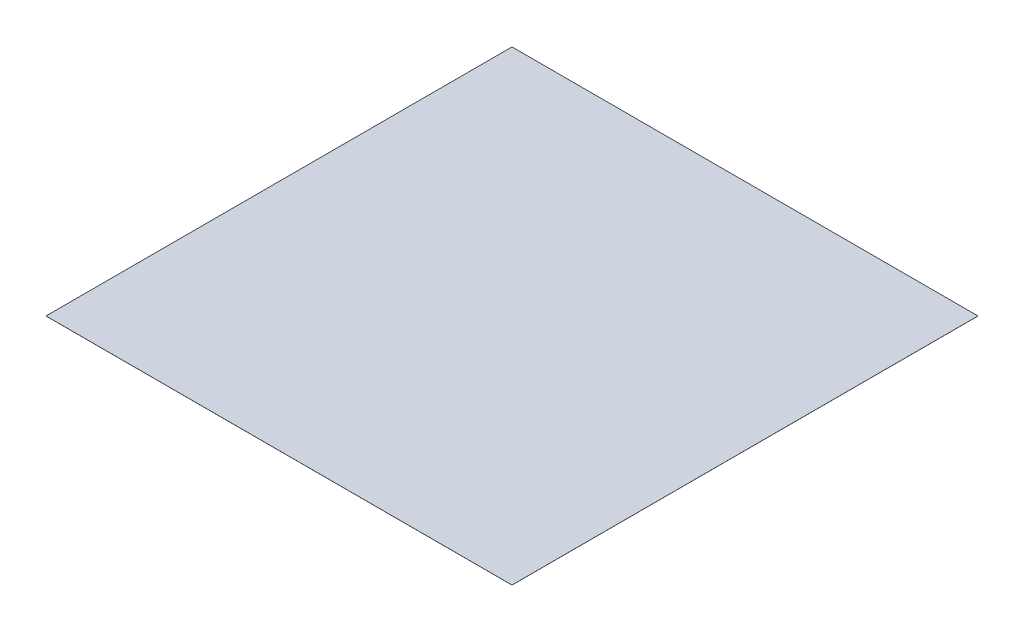
ISO-10303-21;
HEADER;
FILE_DESCRIPTION(('STEP AP214'),'2;1');
FILE_NAME('part.step','',(''),(''),'','','');
FILE_SCHEMA(('AUTOMOTIVE_DESIGN { 1 0 10303 214 1 1 1 1 }'));
ENDSEC;
DATA;
#1=APPLICATION_CONTEXT('core data for automotive mechanical design processes');
#2=APPLICATION_PROTOCOL_DEFINITION('international standard','automotive_design',2000,#1);
#3=PRODUCT_CONTEXT('',#1,'mechanical');
#4=PRODUCT('Part','Part','',(#3));
#5=PRODUCT_RELATED_PRODUCT_CATEGORY('part','',(#4));
#6=PRODUCT_DEFINITION_FORMATION('','',#4);
#7=PRODUCT_DEFINITION_CONTEXT('part definition',#1,'design');
#8=PRODUCT_DEFINITION('design','',#6,#7);
#9=PRODUCT_DEFINITION_SHAPE('','',#8);
#10=(LENGTH_UNIT() NAMED_UNIT(*) SI_UNIT(.MILLI.,.METRE.));
#11=(NAMED_UNIT(*) PLANE_ANGLE_UNIT() SI_UNIT($,.RADIAN.));
#12=(NAMED_UNIT(*) SI_UNIT($,.STERADIAN.) SOLID_ANGLE_UNIT());
#13=UNCERTAINTY_MEASURE_WITH_UNIT(LENGTH_MEASURE(1.E-05),#10,'distance_accuracy_value','');
#14=(GEOMETRIC_REPRESENTATION_CONTEXT(3) GLOBAL_UNCERTAINTY_ASSIGNED_CONTEXT((#13)) GLOBAL_UNIT_ASSIGNED_CONTEXT((#10,
#11,#12)) REPRESENTATION_CONTEXT('',''));
#15=CARTESIAN_POINT('',(0.,0.,0.));
#16=DIRECTION('',(0.,0.,1.));
#17=DIRECTION('',(1.,0.,0.));
#18=AXIS2_PLACEMENT_3D('',#15,#16,#17);
#19=CARTESIAN_POINT('',(1016.,0.254,-1016.));
#20=DIRECTION('',(-1.,0.,0.));
#21=DIRECTION('',(0.,0.,1.));
#22=AXIS2_PLACEMENT_3D('',#19,#20,#21);
#23=PLANE('',#22);
#24=DIRECTION('',(0.,0.,-1.));
#25=VECTOR('',#24,1.);
#26=CARTESIAN_POINT('',(1016.,0.,-1016.));
#27=LINE('',#26,#25);
#28=CARTESIAN_POINT('',(1016.,0.,1016.));
#29=VERTEX_POINT('',#28);
#30=CARTESIAN_POINT('',(1016.,0.,-1016.));
#31=VERTEX_POINT('',#30);
#32=EDGE_CURVE('E97',#29,#31,#27,.T.);
#33=ORIENTED_EDGE('',*,*,#32,.T.);
#34=DIRECTION('',(0.,-1.,0.));
#35=VECTOR('',#34,1.);
#36=CARTESIAN_POINT('',(1016.,0.254,-1016.));
#37=LINE('',#36,#35);
#38=CARTESIAN_POINT('',(1016.,0.254,-1016.));
#39=VERTEX_POINT('',#38);
#40=EDGE_CURVE('E11',#39,#31,#37,.T.);
#41=ORIENTED_EDGE('',*,*,#40,.F.);
#42=DIRECTION('',(0.,0.,-1.));
#43=VECTOR('',#42,1.);
#44=CARTESIAN_POINT('',(1016.,0.254,-1016.));
#45=LINE('',#44,#43);
#46=CARTESIAN_POINT('',(1016.,0.254,1016.));
#47=VERTEX_POINT('',#46);
#48=EDGE_CURVE('E85',#47,#39,#45,.T.);
#49=ORIENTED_EDGE('',*,*,#48,.F.);
#50=DIRECTION('',(0.,-1.,0.));
#51=VECTOR('',#50,1.);
#52=CARTESIAN_POINT('',(1016.,0.254,1016.));
#53=LINE('',#52,#51);
#54=EDGE_CURVE('E93',#47,#29,#53,.T.);
#55=ORIENTED_EDGE('',*,*,#54,.T.);
#56=EDGE_LOOP('',(#33,#41,#49,#55));
#57=FACE_BOUND('',#56,.T.);
#58=ADVANCED_FACE('F34',(#57),#23,.F.);
#59=CARTESIAN_POINT('',(-1016.,0.254,-1016.));
#60=DIRECTION('',(0.,0.,1.));
#61=DIRECTION('',(1.,0.,0.));
#62=AXIS2_PLACEMENT_3D('',#59,#60,#61);
#63=PLANE('',#62);
#64=DIRECTION('',(-1.,0.,0.));
#65=VECTOR('',#64,1.);
#66=CARTESIAN_POINT('',(-1016.,0.,-1016.));
#67=LINE('',#66,#65);
#68=CARTESIAN_POINT('',(-1016.,0.,-1016.));
#69=VERTEX_POINT('',#68);
#70=EDGE_CURVE('E89',#31,#69,#67,.T.);
#71=ORIENTED_EDGE('',*,*,#70,.T.);
#72=DIRECTION('',(0.,-1.,0.));
#73=VECTOR('',#72,1.);
#74=CARTESIAN_POINT('',(-1016.,0.254,-1016.));
#75=LINE('',#74,#73);
#76=CARTESIAN_POINT('',(-1016.,0.254,-1016.));
#77=VERTEX_POINT('',#76);
#78=EDGE_CURVE('E42',#77,#69,#75,.T.);
#79=ORIENTED_EDGE('',*,*,#78,.F.);
#80=DIRECTION('',(-1.,0.,0.));
#81=VECTOR('',#80,1.);
#82=CARTESIAN_POINT('',(-1016.,0.254,-1016.));
#83=LINE('',#82,#81);
#84=EDGE_CURVE('E80',#39,#77,#83,.T.);
#85=ORIENTED_EDGE('',*,*,#84,.F.);
#86=ORIENTED_EDGE('',*,*,#40,.T.);
#87=EDGE_LOOP('',(#71,#79,#85,#86));
#88=FACE_BOUND('',#87,.T.);
#89=ADVANCED_FACE('F88',(#88),#63,.F.);
#90=CARTESIAN_POINT('',(-1016.,0.254,-1016.));
#91=DIRECTION('',(1.,0.,0.));
#92=DIRECTION('',(0.,0.,-1.));
#93=AXIS2_PLACEMENT_3D('',#90,#91,#92);
#94=PLANE('',#93);
#95=DIRECTION('',(0.,0.,1.));
#96=VECTOR('',#95,1.);
#97=CARTESIAN_POINT('',(-1016.,0.,-1016.));
#98=LINE('',#97,#96);
#99=CARTESIAN_POINT('',(-1016.,0.,1016.));
#100=VERTEX_POINT('',#99);
#101=EDGE_CURVE('E67',#69,#100,#98,.T.);
#102=ORIENTED_EDGE('',*,*,#101,.T.);
#103=DIRECTION('',(0.,-1.,0.));
#104=VECTOR('',#103,1.);
#105=CARTESIAN_POINT('',(-1016.,0.254,1016.));
#106=LINE('',#105,#104);
#107=CARTESIAN_POINT('',(-1016.,0.254,1016.));
#108=VERTEX_POINT('',#107);
#109=EDGE_CURVE('E90',#108,#100,#106,.T.);
#110=ORIENTED_EDGE('',*,*,#109,.F.);
#111=DIRECTION('',(0.,0.,1.));
#112=VECTOR('',#111,1.);
#113=CARTESIAN_POINT('',(-1016.,0.254,-1016.));
#114=LINE('',#113,#112);
#115=EDGE_CURVE('E83',#77,#108,#114,.T.);
#116=ORIENTED_EDGE('',*,*,#115,.F.);
#117=ORIENTED_EDGE('',*,*,#78,.T.);
#118=EDGE_LOOP('',(#102,#110,#116,#117));
#119=FACE_BOUND('',#118,.T.);
#120=ADVANCED_FACE('F91',(#119),#94,.F.);
#121=CARTESIAN_POINT('',(-1016.,0.254,1016.));
#122=DIRECTION('',(0.,0.,-1.));
#123=DIRECTION('',(-1.,0.,0.));
#124=AXIS2_PLACEMENT_3D('',#121,#122,#123);
#125=PLANE('',#124);
#126=DIRECTION('',(1.,0.,0.));
#127=VECTOR('',#126,1.);
#128=CARTESIAN_POINT('',(-1016.,0.,1016.));
#129=LINE('',#128,#127);
#130=EDGE_CURVE('E73',#100,#29,#129,.T.);
#131=ORIENTED_EDGE('',*,*,#130,.T.);
#132=ORIENTED_EDGE('',*,*,#54,.F.);
#133=DIRECTION('',(1.,0.,0.));
#134=VECTOR('',#133,1.);
#135=CARTESIAN_POINT('',(-1016.,0.254,1016.));
#136=LINE('',#135,#134);
#137=EDGE_CURVE('E50',#108,#47,#136,.T.);
#138=ORIENTED_EDGE('',*,*,#137,.F.);
#139=ORIENTED_EDGE('',*,*,#109,.T.);
#140=EDGE_LOOP('',(#131,#132,#138,#139));
#141=FACE_BOUND('',#140,.T.);
#142=ADVANCED_FACE('F104',(#141),#125,.F.);
#143=CARTESIAN_POINT('',(0.,0.254,0.));
#144=DIRECTION('',(0.,1.,0.));
#145=DIRECTION('',(0.,0.,1.));
#146=AXIS2_PLACEMENT_3D('',#143,#144,#145);
#147=PLANE('',#146);
#148=ORIENTED_EDGE('',*,*,#48,.T.);
#149=ORIENTED_EDGE('',*,*,#84,.T.);
#150=ORIENTED_EDGE('',*,*,#115,.T.);
#151=ORIENTED_EDGE('',*,*,#137,.T.);
#152=EDGE_LOOP('',(#148,#149,#150,#151));
#153=FACE_BOUND('',#152,.T.);
#154=ADVANCED_FACE('F81',(#153),#147,.T.);
#155=CARTESIAN_POINT('',(0.,0.,0.));
#156=DIRECTION('',(0.,1.,0.));
#157=DIRECTION('',(0.,0.,1.));
#158=AXIS2_PLACEMENT_3D('',#155,#156,#157);
#159=PLANE('',#158);
#160=ORIENTED_EDGE('',*,*,#32,.F.);
#161=ORIENTED_EDGE('',*,*,#130,.F.);
#162=ORIENTED_EDGE('',*,*,#101,.F.);
#163=ORIENTED_EDGE('',*,*,#70,.F.);
#164=EDGE_LOOP('',(#160,#161,#162,#163));
#165=FACE_BOUND('',#164,.T.);
#166=ADVANCED_FACE('F107',(#165),#159,.F.);
#167=CLOSED_SHELL('',(#58,#89,#120,#142,#154,#166));
#168=MANIFOLD_SOLID_BREP('B2',#167);
#169=ADVANCED_BREP_SHAPE_REPRESENTATION('',(#18,#168),#14);
#170=SHAPE_DEFINITION_REPRESENTATION(#9,#169);
ENDSEC;
END-ISO-10303-21;
